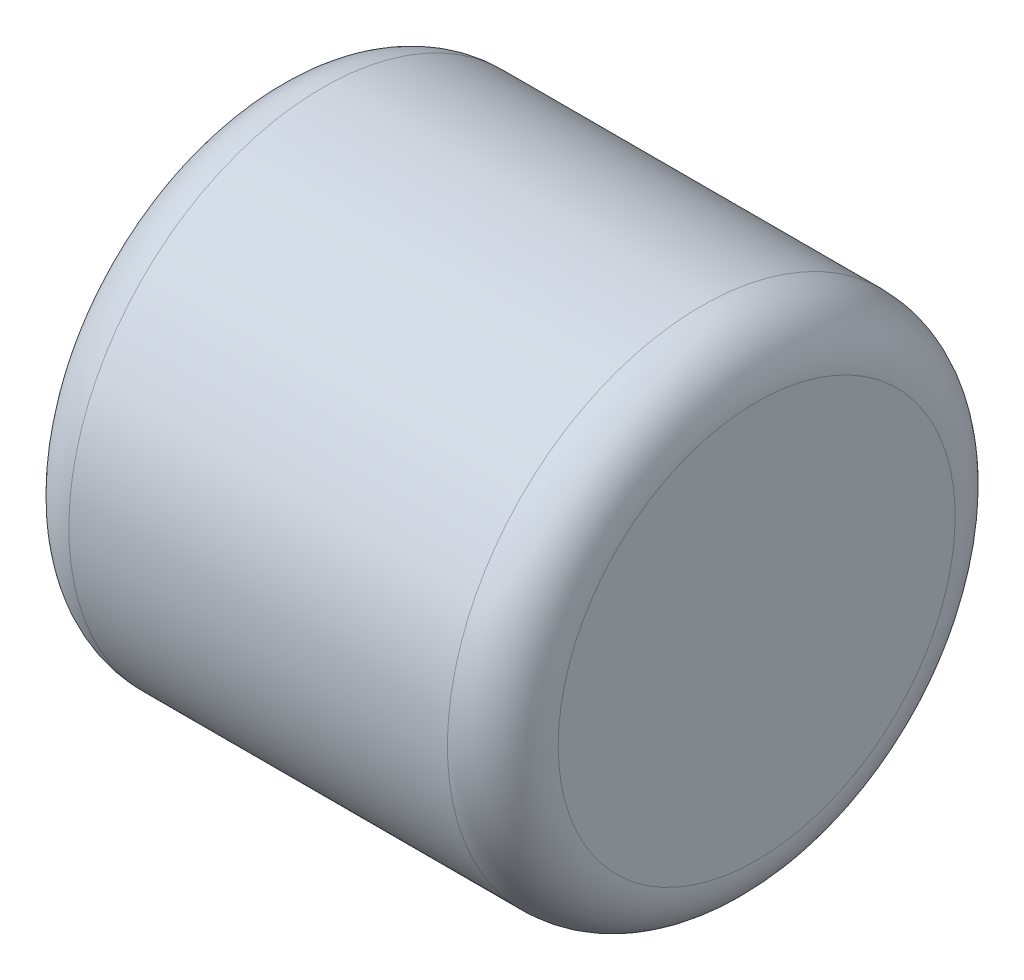
ISO-10303-21;
HEADER;
FILE_DESCRIPTION(('STEP AP214'),'2;1');
FILE_NAME('part.step','',(''),(''),'','','');
FILE_SCHEMA(('AUTOMOTIVE_DESIGN { 1 0 10303 214 1 1 1 1 }'));
ENDSEC;
DATA;
#1=APPLICATION_CONTEXT('core data for automotive mechanical design processes');
#2=APPLICATION_PROTOCOL_DEFINITION('international standard','automotive_design',2000,#1);
#3=PRODUCT_CONTEXT('',#1,'mechanical');
#4=PRODUCT('Part','Part','',(#3));
#5=PRODUCT_RELATED_PRODUCT_CATEGORY('part','',(#4));
#6=PRODUCT_DEFINITION_FORMATION('','',#4);
#7=PRODUCT_DEFINITION_CONTEXT('part definition',#1,'design');
#8=PRODUCT_DEFINITION('design','',#6,#7);
#9=PRODUCT_DEFINITION_SHAPE('','',#8);
#10=(LENGTH_UNIT() NAMED_UNIT(*) SI_UNIT(.MILLI.,.METRE.));
#11=(NAMED_UNIT(*) PLANE_ANGLE_UNIT() SI_UNIT($,.RADIAN.));
#12=(NAMED_UNIT(*) SI_UNIT($,.STERADIAN.) SOLID_ANGLE_UNIT());
#13=UNCERTAINTY_MEASURE_WITH_UNIT(LENGTH_MEASURE(1.E-05),#10,'distance_accuracy_value','');
#14=(GEOMETRIC_REPRESENTATION_CONTEXT(3) GLOBAL_UNCERTAINTY_ASSIGNED_CONTEXT((#13)) GLOBAL_UNIT_ASSIGNED_CONTEXT((#10,
#11,#12)) REPRESENTATION_CONTEXT('',''));
#15=CARTESIAN_POINT('',(0.,0.,0.));
#16=DIRECTION('',(0.,0.,1.));
#17=DIRECTION('',(1.,0.,0.));
#18=AXIS2_PLACEMENT_3D('',#15,#16,#17);
#19=CARTESIAN_POINT('',(8.15,-12.4,1.075));
#20=DIRECTION('',(1.,0.,0.));
#21=DIRECTION('',(0.,1.,0.));
#22=AXIS2_PLACEMENT_3D('',#19,#20,#21);
#23=PLANE('',#22);
#24=CARTESIAN_POINT('',(8.15,-12.4,0.));
#25=DIRECTION('',(-1.,0.,0.));
#26=DIRECTION('',(0.,0.,1.));
#27=AXIS2_PLACEMENT_3D('',#24,#25,#26);
#28=CIRCLE('',#27,2.15);
#29=CARTESIAN_POINT('',(8.15,-12.4,2.15));
#30=VERTEX_POINT('',#29);
#31=EDGE_CURVE('E61',#30,#30,#28,.T.);
#32=ORIENTED_EDGE('',*,*,#31,.F.);
#33=EDGE_LOOP('',(#32));
#34=FACE_BOUND('',#33,.T.);
#35=ADVANCED_FACE('F14',(#34),#23,.T.);
#36=CARTESIAN_POINT('',(2.85,-12.4,1.075));
#37=DIRECTION('',(-1.,0.,0.));
#38=DIRECTION('',(0.,-1.,0.));
#39=AXIS2_PLACEMENT_3D('',#36,#37,#38);
#40=PLANE('',#39);
#41=CARTESIAN_POINT('',(2.85,-12.4,0.));
#42=DIRECTION('',(1.,0.,0.));
#43=DIRECTION('',(0.,0.,1.));
#44=AXIS2_PLACEMENT_3D('',#41,#42,#43);
#45=CIRCLE('',#44,2.15);
#46=CARTESIAN_POINT('',(2.85,-12.4,2.15));
#47=VERTEX_POINT('',#46);
#48=EDGE_CURVE('E29',#47,#47,#45,.T.);
#49=ORIENTED_EDGE('',*,*,#48,.F.);
#50=EDGE_LOOP('',(#49));
#51=FACE_BOUND('',#50,.T.);
#52=ADVANCED_FACE('F74',(#51),#40,.T.);
#53=CARTESIAN_POINT('',(7.55,-12.4,0.));
#54=DIRECTION('',(-1.,0.,0.));
#55=DIRECTION('',(0.,-1.,0.));
#56=AXIS2_PLACEMENT_3D('',#53,#54,#55);
#57=TOROIDAL_SURFACE('',#56,2.15,0.600000000000001);
#58=ORIENTED_EDGE('',*,*,#31,.T.);
#59=EDGE_LOOP('',(#58));
#60=FACE_BOUND('',#59,.T.);
#61=CARTESIAN_POINT('',(7.55,-12.4,0.));
#62=DIRECTION('',(-1.,0.,0.));
#63=DIRECTION('',(0.,-1.,0.));
#64=AXIS2_PLACEMENT_3D('',#61,#62,#63);
#65=CIRCLE('',#64,2.75);
#66=CARTESIAN_POINT('',(7.55,-15.15,0.));
#67=VERTEX_POINT('',#66);
#68=EDGE_CURVE('E24',#67,#67,#65,.T.);
#69=ORIENTED_EDGE('',*,*,#68,.F.);
#70=EDGE_LOOP('',(#69));
#71=FACE_BOUND('',#70,.T.);
#72=ADVANCED_FACE('F42',(#60,#71),#57,.T.);
#73=CARTESIAN_POINT('',(3.45,-12.4,0.));
#74=DIRECTION('',(-1.,0.,0.));
#75=DIRECTION('',(0.,-1.,0.));
#76=AXIS2_PLACEMENT_3D('',#73,#74,#75);
#77=TOROIDAL_SURFACE('',#76,2.15,0.6);
#78=CARTESIAN_POINT('',(3.45,-12.4,0.));
#79=DIRECTION('',(-1.,0.,0.));
#80=DIRECTION('',(0.,-1.,0.));
#81=AXIS2_PLACEMENT_3D('',#78,#79,#80);
#82=CIRCLE('',#81,2.75);
#83=CARTESIAN_POINT('',(3.45,-15.15,0.));
#84=VERTEX_POINT('',#83);
#85=EDGE_CURVE('E10',#84,#84,#82,.F.);
#86=ORIENTED_EDGE('',*,*,#85,.F.);
#87=EDGE_LOOP('',(#86));
#88=FACE_BOUND('',#87,.T.);
#89=ORIENTED_EDGE('',*,*,#48,.T.);
#90=EDGE_LOOP('',(#89));
#91=FACE_BOUND('',#90,.T.);
#92=ADVANCED_FACE('F37',(#88,#91),#77,.T.);
#93=CARTESIAN_POINT('',(5.5,-12.4,0.));
#94=DIRECTION('',(-1.,0.,0.));
#95=DIRECTION('',(0.,-1.,0.));
#96=AXIS2_PLACEMENT_3D('',#93,#94,#95);
#97=CYLINDRICAL_SURFACE('',#96,2.75);
#98=ORIENTED_EDGE('',*,*,#68,.T.);
#99=EDGE_LOOP('',(#98));
#100=FACE_BOUND('',#99,.T.);
#101=ORIENTED_EDGE('',*,*,#85,.T.);
#102=EDGE_LOOP('',(#101));
#103=FACE_BOUND('',#102,.T.);
#104=ADVANCED_FACE('F41',(#100,#103),#97,.T.);
#105=CLOSED_SHELL('',(#35,#52,#72,#92,#104));
#106=MANIFOLD_SOLID_BREP('B1',#105);
#107=ADVANCED_BREP_SHAPE_REPRESENTATION('',(#18,#106),#14);
#108=SHAPE_DEFINITION_REPRESENTATION(#9,#107);
ENDSEC;
END-ISO-10303-21;
